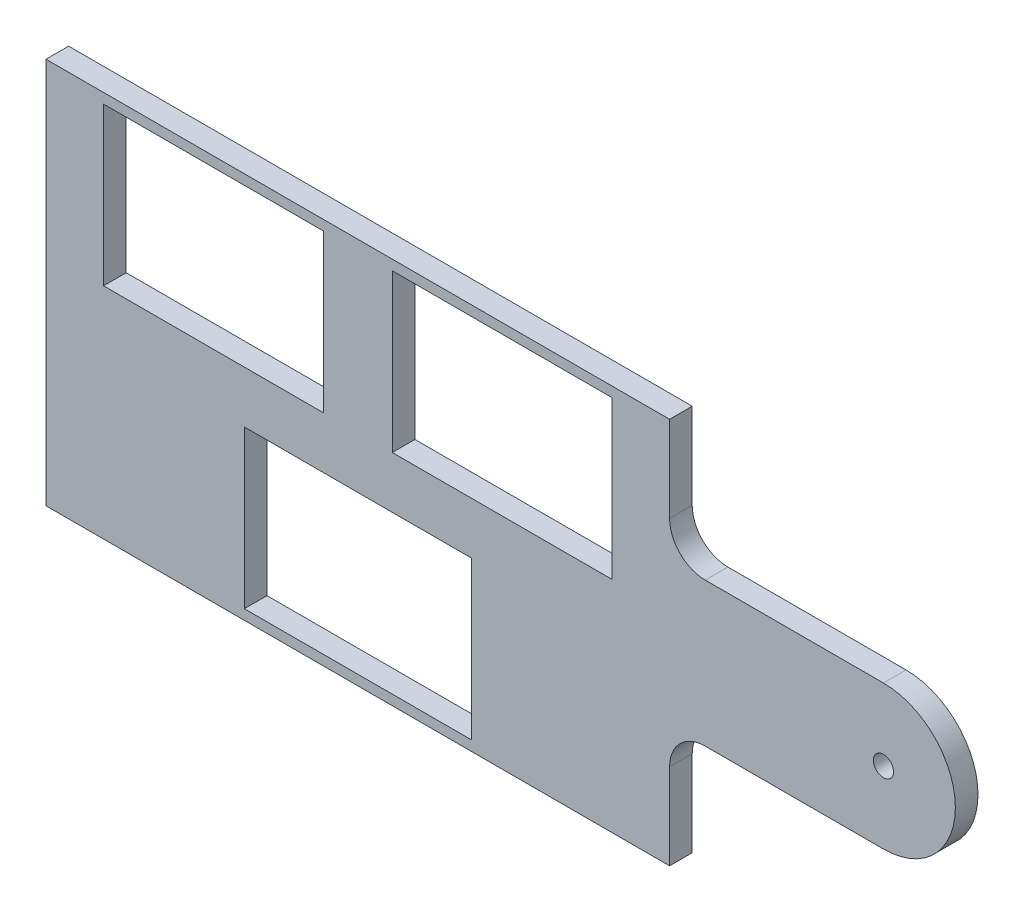
ISO-10303-21;
HEADER;
FILE_DESCRIPTION(('STEP AP214'),'2;1');
FILE_NAME('part.step','',(''),(''),'','','');
FILE_SCHEMA(('AUTOMOTIVE_DESIGN { 1 0 10303 214 1 1 1 1 }'));
ENDSEC;
DATA;
#1=APPLICATION_CONTEXT('core data for automotive mechanical design processes');
#2=APPLICATION_PROTOCOL_DEFINITION('international standard','automotive_design',2000,#1);
#3=PRODUCT_CONTEXT('',#1,'mechanical');
#4=PRODUCT('Part','Part','',(#3));
#5=PRODUCT_RELATED_PRODUCT_CATEGORY('part','',(#4));
#6=PRODUCT_DEFINITION_FORMATION('','',#4);
#7=PRODUCT_DEFINITION_CONTEXT('part definition',#1,'design');
#8=PRODUCT_DEFINITION('design','',#6,#7);
#9=PRODUCT_DEFINITION_SHAPE('','',#8);
#10=(LENGTH_UNIT() NAMED_UNIT(*) SI_UNIT(.MILLI.,.METRE.));
#11=(NAMED_UNIT(*) PLANE_ANGLE_UNIT() SI_UNIT($,.RADIAN.));
#12=(NAMED_UNIT(*) SI_UNIT($,.STERADIAN.) SOLID_ANGLE_UNIT());
#13=UNCERTAINTY_MEASURE_WITH_UNIT(LENGTH_MEASURE(1.E-05),#10,'distance_accuracy_value','');
#14=(GEOMETRIC_REPRESENTATION_CONTEXT(3) GLOBAL_UNCERTAINTY_ASSIGNED_CONTEXT((#13)) GLOBAL_UNIT_ASSIGNED_CONTEXT((#10,
#11,#12)) REPRESENTATION_CONTEXT('',''));
#15=CARTESIAN_POINT('',(0.,0.,0.));
#16=DIRECTION('',(0.,0.,1.));
#17=DIRECTION('',(1.,0.,0.));
#18=AXIS2_PLACEMENT_3D('',#15,#16,#17);
#19=CARTESIAN_POINT('',(0.,0.,3.175));
#20=DIRECTION('',(0.,0.,1.));
#21=DIRECTION('',(1.,0.,0.));
#22=AXIS2_PLACEMENT_3D('',#19,#20,#21);
#23=PLANE('',#22);
#24=DIRECTION('',(0.,-1.,0.));
#25=VECTOR('',#24,1.);
#26=CARTESIAN_POINT('',(-15.915,-3.63500000000001,3.175));
#27=LINE('',#26,#25);
#28=CARTESIAN_POINT('',(-15.915,-3.63500000000001,3.175));
#29=VERTEX_POINT('',#28);
#30=CARTESIAN_POINT('',(-15.915,-25.715,3.175));
#31=VERTEX_POINT('',#30);
#32=EDGE_CURVE('E51',#29,#31,#27,.T.);
#33=ORIENTED_EDGE('',*,*,#32,.F.);
#34=DIRECTION('',(-1.,0.,0.));
#35=VECTOR('',#34,1.);
#36=CARTESIAN_POINT('',(15.915,-3.63500000000001,3.175));
#37=LINE('',#36,#35);
#38=CARTESIAN_POINT('',(15.915,-3.63500000000001,3.175));
#39=VERTEX_POINT('',#38);
#40=EDGE_CURVE('E249',#39,#29,#37,.T.);
#41=ORIENTED_EDGE('',*,*,#40,.F.);
#42=DIRECTION('',(0.,-1.,0.));
#43=VECTOR('',#42,1.);
#44=CARTESIAN_POINT('',(15.915,-3.63500000000001,3.175));
#45=LINE('',#44,#43);
#46=CARTESIAN_POINT('',(15.915,-25.715,3.175));
#47=VERTEX_POINT('',#46);
#48=EDGE_CURVE('E257',#39,#47,#45,.T.);
#49=ORIENTED_EDGE('',*,*,#48,.T.);
#50=DIRECTION('',(1.,0.,0.));
#51=VECTOR('',#50,1.);
#52=CARTESIAN_POINT('',(-15.915,-25.715,3.175));
#53=LINE('',#52,#51);
#54=EDGE_CURVE('E260',#31,#47,#53,.T.);
#55=ORIENTED_EDGE('',*,*,#54,.F.);
#56=EDGE_LOOP('',(#33,#41,#49,#55));
#57=FACE_BOUND('',#56,.T.);
#58=DIRECTION('',(0.,1.,0.));
#59=VECTOR('',#58,1.);
#60=CARTESIAN_POINT('',(43.735,30.3,3.175));
#61=LINE('',#60,#59);
#62=CARTESIAN_POINT('',(43.735,15.085,3.175));
#63=VERTEX_POINT('',#62);
#64=CARTESIAN_POINT('',(43.735,27.125,3.175));
#65=VERTEX_POINT('',#64);
#66=EDGE_CURVE('E198',#63,#65,#61,.T.);
#67=ORIENTED_EDGE('',*,*,#66,.T.);
#68=DIRECTION('',(-1.,0.,0.));
#69=VECTOR('',#68,1.);
#70=CARTESIAN_POINT('',(-43.735,27.125,3.175));
#71=LINE('',#70,#69);
#72=CARTESIAN_POINT('',(-43.735,27.125,3.175));
#73=VERTEX_POINT('',#72);
#74=EDGE_CURVE('E217',#65,#73,#71,.T.);
#75=ORIENTED_EDGE('',*,*,#74,.T.);
#76=DIRECTION('',(0.,-1.,0.));
#77=VECTOR('',#76,1.);
#78=CARTESIAN_POINT('',(-43.735,30.3,3.175));
#79=LINE('',#78,#77);
#80=CARTESIAN_POINT('',(-43.735,-27.125,3.175));
#81=VERTEX_POINT('',#80);
#82=EDGE_CURVE('E312',#73,#81,#79,.T.);
#83=ORIENTED_EDGE('',*,*,#82,.T.);
#84=DIRECTION('',(1.,0.,0.));
#85=VECTOR('',#84,1.);
#86=CARTESIAN_POINT('',(43.735,-27.125,3.175));
#87=LINE('',#86,#85);
#88=CARTESIAN_POINT('',(43.735,-27.125,3.175));
#89=VERTEX_POINT('',#88);
#90=EDGE_CURVE('E207',#81,#89,#87,.T.);
#91=ORIENTED_EDGE('',*,*,#90,.T.);
#92=CARTESIAN_POINT('',(43.735,-15.085,3.175));
#93=VERTEX_POINT('',#92);
#94=EDGE_CURVE('E310',#89,#93,#61,.T.);
#95=ORIENTED_EDGE('',*,*,#94,.T.);
#96=CARTESIAN_POINT('',(48.735,-15.085,3.175));
#97=DIRECTION('',(0.,0.,1.));
#98=DIRECTION('',(1.,0.,0.));
#99=AXIS2_PLACEMENT_3D('',#96,#97,#98);
#100=CIRCLE('',#99,5.);
#101=CARTESIAN_POINT('',(48.735,-10.085,3.175));
#102=VERTEX_POINT('',#101);
#103=EDGE_CURVE('E325',#93,#102,#100,.F.);
#104=ORIENTED_EDGE('',*,*,#103,.T.);
#105=DIRECTION('',(1.,0.,0.));
#106=VECTOR('',#105,1.);
#107=CARTESIAN_POINT('',(43.735,-10.085,3.175));
#108=LINE('',#107,#106);
#109=CARTESIAN_POINT('',(73.735,-10.085,3.175));
#110=VERTEX_POINT('',#109);
#111=EDGE_CURVE('E292',#102,#110,#108,.T.);
#112=ORIENTED_EDGE('',*,*,#111,.T.);
#113=CARTESIAN_POINT('',(73.735,0.,3.175));
#114=DIRECTION('',(0.,0.,1.));
#115=DIRECTION('',(-1.,0.,0.));
#116=AXIS2_PLACEMENT_3D('',#113,#114,#115);
#117=CIRCLE('',#116,10.085);
#118=CARTESIAN_POINT('',(73.735,10.085,3.175));
#119=VERTEX_POINT('',#118);
#120=EDGE_CURVE('E298',#110,#119,#117,.T.);
#121=ORIENTED_EDGE('',*,*,#120,.T.);
#122=DIRECTION('',(-1.,0.,0.));
#123=VECTOR('',#122,1.);
#124=CARTESIAN_POINT('',(43.735,10.085,3.175));
#125=LINE('',#124,#123);
#126=CARTESIAN_POINT('',(48.735,10.085,3.175));
#127=VERTEX_POINT('',#126);
#128=EDGE_CURVE('E301',#119,#127,#125,.T.);
#129=ORIENTED_EDGE('',*,*,#128,.T.);
#130=CARTESIAN_POINT('',(48.735,15.085,3.175));
#131=DIRECTION('',(0.,0.,1.));
#132=DIRECTION('',(1.,0.,0.));
#133=AXIS2_PLACEMENT_3D('',#130,#131,#132);
#134=CIRCLE('',#133,5.);
#135=EDGE_CURVE('E329',#127,#63,#134,.F.);
#136=ORIENTED_EDGE('',*,*,#135,.T.);
#137=EDGE_LOOP('',(#67,#75,#83,#91,#95,#104,#112,#121,#129,#136));
#138=FACE_BOUND('',#137,.T.);
#139=CARTESIAN_POINT('',(73.735,0.,3.175));
#140=DIRECTION('',(0.,0.,1.));
#141=DIRECTION('',(1.,0.,0.));
#142=AXIS2_PLACEMENT_3D('',#139,#140,#141);
#143=CIRCLE('',#142,1.415);
#144=CARTESIAN_POINT('',(75.15,0.,3.175));
#145=VERTEX_POINT('',#144);
#146=EDGE_CURVE('E284',#145,#145,#143,.T.);
#147=ORIENTED_EDGE('',*,*,#146,.F.);
#148=EDGE_LOOP('',(#147));
#149=FACE_BOUND('',#148,.T.);
#150=DIRECTION('',(0.,-1.,0.));
#151=VECTOR('',#150,1.);
#152=CARTESIAN_POINT('',(-35.665,25.715,3.175));
#153=LINE('',#152,#151);
#154=CARTESIAN_POINT('',(-35.665,25.715,3.175));
#155=VERTEX_POINT('',#154);
#156=CARTESIAN_POINT('',(-35.665,3.635,3.175));
#157=VERTEX_POINT('',#156);
#158=EDGE_CURVE('E272',#155,#157,#153,.T.);
#159=ORIENTED_EDGE('',*,*,#158,.F.);
#160=DIRECTION('',(1.,0.,0.));
#161=VECTOR('',#160,1.);
#162=CARTESIAN_POINT('',(-35.665,25.715,3.175));
#163=LINE('',#162,#161);
#164=CARTESIAN_POINT('',(-4.835,25.715,3.175));
#165=VERTEX_POINT('',#164);
#166=EDGE_CURVE('E246',#155,#165,#163,.T.);
#167=ORIENTED_EDGE('',*,*,#166,.T.);
#168=DIRECTION('',(0.,-1.,0.));
#169=VECTOR('',#168,1.);
#170=CARTESIAN_POINT('',(-4.835,25.715,3.175));
#171=LINE('',#170,#169);
#172=CARTESIAN_POINT('',(-4.835,3.635,3.175));
#173=VERTEX_POINT('',#172);
#174=EDGE_CURVE('E266',#165,#173,#171,.T.);
#175=ORIENTED_EDGE('',*,*,#174,.T.);
#176=DIRECTION('',(1.,0.,0.));
#177=VECTOR('',#176,1.);
#178=CARTESIAN_POINT('',(-35.665,3.635,3.175));
#179=LINE('',#178,#177);
#180=EDGE_CURVE('E269',#157,#173,#179,.T.);
#181=ORIENTED_EDGE('',*,*,#180,.F.);
#182=EDGE_LOOP('',(#159,#167,#175,#181));
#183=FACE_BOUND('',#182,.T.);
#184=DIRECTION('',(-1.,0.,0.));
#185=VECTOR('',#184,1.);
#186=CARTESIAN_POINT('',(35.665,25.715,3.175));
#187=LINE('',#186,#185);
#188=CARTESIAN_POINT('',(35.665,25.715,3.175));
#189=VERTEX_POINT('',#188);
#190=CARTESIAN_POINT('',(4.835,25.715,3.175));
#191=VERTEX_POINT('',#190);
#192=EDGE_CURVE('E236',#189,#191,#187,.T.);
#193=ORIENTED_EDGE('',*,*,#192,.F.);
#194=DIRECTION('',(0.,-1.,0.));
#195=VECTOR('',#194,1.);
#196=CARTESIAN_POINT('',(35.665,25.715,3.175));
#197=LINE('',#196,#195);
#198=CARTESIAN_POINT('',(35.665,3.635,3.175));
#199=VERTEX_POINT('',#198);
#200=EDGE_CURVE('E59',#189,#199,#197,.T.);
#201=ORIENTED_EDGE('',*,*,#200,.T.);
#202=DIRECTION('',(-1.,0.,0.));
#203=VECTOR('',#202,1.);
#204=CARTESIAN_POINT('',(35.665,3.635,3.175));
#205=LINE('',#204,#203);
#206=CARTESIAN_POINT('',(4.835,3.635,3.175));
#207=VERTEX_POINT('',#206);
#208=EDGE_CURVE('E242',#199,#207,#205,.T.);
#209=ORIENTED_EDGE('',*,*,#208,.T.);
#210=DIRECTION('',(0.,-1.,0.));
#211=VECTOR('',#210,1.);
#212=CARTESIAN_POINT('',(4.835,25.715,3.175));
#213=LINE('',#212,#211);
#214=EDGE_CURVE('E239',#191,#207,#213,.T.);
#215=ORIENTED_EDGE('',*,*,#214,.F.);
#216=EDGE_LOOP('',(#193,#201,#209,#215));
#217=FACE_BOUND('',#216,.T.);
#218=ADVANCED_FACE('F36',(#57,#138,#149,#183,#217),#23,.T.);
#219=CARTESIAN_POINT('',(0.,0.,0.));
#220=DIRECTION('',(0.,0.,1.));
#221=DIRECTION('',(1.,0.,0.));
#222=AXIS2_PLACEMENT_3D('',#219,#220,#221);
#223=PLANE('',#222);
#224=DIRECTION('',(-1.,0.,0.));
#225=VECTOR('',#224,1.);
#226=CARTESIAN_POINT('',(0.,-3.63500000000001,0.));
#227=LINE('',#226,#225);
#228=CARTESIAN_POINT('',(15.915,-3.63500000000001,0.));
#229=VERTEX_POINT('',#228);
#230=CARTESIAN_POINT('',(-15.915,-3.63500000000001,0.));
#231=VERTEX_POINT('',#230);
#232=EDGE_CURVE('E44',#229,#231,#227,.T.);
#233=ORIENTED_EDGE('',*,*,#232,.T.);
#234=DIRECTION('',(0.,-1.,0.));
#235=VECTOR('',#234,1.);
#236=CARTESIAN_POINT('',(-15.915,0.,0.));
#237=LINE('',#236,#235);
#238=CARTESIAN_POINT('',(-15.915,-25.715,0.));
#239=VERTEX_POINT('',#238);
#240=EDGE_CURVE('E11',#231,#239,#237,.T.);
#241=ORIENTED_EDGE('',*,*,#240,.T.);
#242=DIRECTION('',(1.,0.,0.));
#243=VECTOR('',#242,1.);
#244=CARTESIAN_POINT('',(0.,-25.715,0.));
#245=LINE('',#244,#243);
#246=CARTESIAN_POINT('',(15.915,-25.715,0.));
#247=VERTEX_POINT('',#246);
#248=EDGE_CURVE('E355',#239,#247,#245,.T.);
#249=ORIENTED_EDGE('',*,*,#248,.T.);
#250=DIRECTION('',(0.,-1.,0.));
#251=VECTOR('',#250,1.);
#252=CARTESIAN_POINT('',(15.915,0.,0.));
#253=LINE('',#252,#251);
#254=EDGE_CURVE('E358',#229,#247,#253,.T.);
#255=ORIENTED_EDGE('',*,*,#254,.F.);
#256=EDGE_LOOP('',(#233,#241,#249,#255));
#257=FACE_BOUND('',#256,.T.);
#258=DIRECTION('',(1.,0.,0.));
#259=VECTOR('',#258,1.);
#260=CARTESIAN_POINT('',(0.,25.715,0.));
#261=LINE('',#260,#259);
#262=CARTESIAN_POINT('',(-35.665,25.715,0.));
#263=VERTEX_POINT('',#262);
#264=CARTESIAN_POINT('',(-4.835,25.715,0.));
#265=VERTEX_POINT('',#264);
#266=EDGE_CURVE('E343',#263,#265,#261,.T.);
#267=ORIENTED_EDGE('',*,*,#266,.F.);
#268=DIRECTION('',(0.,-1.,0.));
#269=VECTOR('',#268,1.);
#270=CARTESIAN_POINT('',(-35.665,0.,0.));
#271=LINE('',#270,#269);
#272=CARTESIAN_POINT('',(-35.665,3.635,0.));
#273=VERTEX_POINT('',#272);
#274=EDGE_CURVE('E333',#263,#273,#271,.T.);
#275=ORIENTED_EDGE('',*,*,#274,.T.);
#276=DIRECTION('',(1.,0.,0.));
#277=VECTOR('',#276,1.);
#278=CARTESIAN_POINT('',(0.,3.635,0.));
#279=LINE('',#278,#277);
#280=CARTESIAN_POINT('',(-4.835,3.635,0.));
#281=VERTEX_POINT('',#280);
#282=EDGE_CURVE('E338',#273,#281,#279,.T.);
#283=ORIENTED_EDGE('',*,*,#282,.T.);
#284=DIRECTION('',(0.,-1.,0.));
#285=VECTOR('',#284,1.);
#286=CARTESIAN_POINT('',(-4.835,0.,0.));
#287=LINE('',#286,#285);
#288=EDGE_CURVE('E341',#265,#281,#287,.T.);
#289=ORIENTED_EDGE('',*,*,#288,.F.);
#290=EDGE_LOOP('',(#267,#275,#283,#289));
#291=FACE_BOUND('',#290,.T.);
#292=CARTESIAN_POINT('',(73.735,0.,0.));
#293=DIRECTION('',(0.,0.,1.));
#294=DIRECTION('',(1.,0.,0.));
#295=AXIS2_PLACEMENT_3D('',#292,#293,#294);
#296=CIRCLE('',#295,1.415);
#297=CARTESIAN_POINT('',(75.15,0.,0.));
#298=VERTEX_POINT('',#297);
#299=EDGE_CURVE('E287',#298,#298,#296,.T.);
#300=ORIENTED_EDGE('',*,*,#299,.T.);
#301=EDGE_LOOP('',(#300));
#302=FACE_BOUND('',#301,.T.);
#303=DIRECTION('',(0.,-1.,0.));
#304=VECTOR('',#303,1.);
#305=CARTESIAN_POINT('',(-43.735,30.3,0.));
#306=LINE('',#305,#304);
#307=CARTESIAN_POINT('',(-43.735,27.125,0.));
#308=VERTEX_POINT('',#307);
#309=CARTESIAN_POINT('',(-43.735,-27.125,0.));
#310=VERTEX_POINT('',#309);
#311=EDGE_CURVE('E187',#308,#310,#306,.T.);
#312=ORIENTED_EDGE('',*,*,#311,.F.);
#313=DIRECTION('',(-1.,0.,0.));
#314=VECTOR('',#313,1.);
#315=CARTESIAN_POINT('',(-43.735,27.125,0.));
#316=LINE('',#315,#314);
#317=CARTESIAN_POINT('',(43.735,27.125,0.));
#318=VERTEX_POINT('',#317);
#319=EDGE_CURVE('E219',#318,#308,#316,.T.);
#320=ORIENTED_EDGE('',*,*,#319,.F.);
#321=DIRECTION('',(0.,1.,0.));
#322=VECTOR('',#321,1.);
#323=CARTESIAN_POINT('',(43.735,30.3,0.));
#324=LINE('',#323,#322);
#325=CARTESIAN_POINT('',(43.735,15.085,0.));
#326=VERTEX_POINT('',#325);
#327=EDGE_CURVE('E308',#326,#318,#324,.T.);
#328=ORIENTED_EDGE('',*,*,#327,.F.);
#329=CARTESIAN_POINT('',(48.735,15.085,0.));
#330=DIRECTION('',(0.,0.,1.));
#331=DIRECTION('',(1.,0.,0.));
#332=AXIS2_PLACEMENT_3D('',#329,#330,#331);
#333=CIRCLE('',#332,5.);
#334=CARTESIAN_POINT('',(48.735,10.085,0.));
#335=VERTEX_POINT('',#334);
#336=EDGE_CURVE('E331',#326,#335,#333,.T.);
#337=ORIENTED_EDGE('',*,*,#336,.T.);
#338=DIRECTION('',(-1.,0.,0.));
#339=VECTOR('',#338,1.);
#340=CARTESIAN_POINT('',(43.735,10.085,0.));
#341=LINE('',#340,#339);
#342=CARTESIAN_POINT('',(73.735,10.085,0.));
#343=VERTEX_POINT('',#342);
#344=EDGE_CURVE('E291',#343,#335,#341,.T.);
#345=ORIENTED_EDGE('',*,*,#344,.F.);
#346=CARTESIAN_POINT('',(73.735,0.,0.));
#347=DIRECTION('',(0.,0.,1.));
#348=DIRECTION('',(-1.,0.,0.));
#349=AXIS2_PLACEMENT_3D('',#346,#347,#348);
#350=CIRCLE('',#349,10.085);
#351=CARTESIAN_POINT('',(73.735,-10.085,0.));
#352=VERTEX_POINT('',#351);
#353=EDGE_CURVE('E288',#352,#343,#350,.T.);
#354=ORIENTED_EDGE('',*,*,#353,.F.);
#355=DIRECTION('',(1.,0.,0.));
#356=VECTOR('',#355,1.);
#357=CARTESIAN_POINT('',(43.735,-10.085,0.));
#358=LINE('',#357,#356);
#359=CARTESIAN_POINT('',(48.735,-10.085,0.));
#360=VERTEX_POINT('',#359);
#361=EDGE_CURVE('E295',#360,#352,#358,.T.);
#362=ORIENTED_EDGE('',*,*,#361,.F.);
#363=CARTESIAN_POINT('',(48.735,-15.085,0.));
#364=DIRECTION('',(0.,0.,1.));
#365=DIRECTION('',(1.,0.,0.));
#366=AXIS2_PLACEMENT_3D('',#363,#364,#365);
#367=CIRCLE('',#366,5.);
#368=CARTESIAN_POINT('',(43.735,-15.085,0.));
#369=VERTEX_POINT('',#368);
#370=EDGE_CURVE('E327',#360,#369,#367,.T.);
#371=ORIENTED_EDGE('',*,*,#370,.T.);
#372=CARTESIAN_POINT('',(43.735,-27.125,0.));
#373=VERTEX_POINT('',#372);
#374=EDGE_CURVE('E199',#373,#369,#324,.T.);
#375=ORIENTED_EDGE('',*,*,#374,.F.);
#376=DIRECTION('',(1.,0.,0.));
#377=VECTOR('',#376,1.);
#378=CARTESIAN_POINT('',(43.735,-27.125,0.));
#379=LINE('',#378,#377);
#380=EDGE_CURVE('E205',#310,#373,#379,.T.);
#381=ORIENTED_EDGE('',*,*,#380,.F.);
#382=EDGE_LOOP('',(#312,#320,#328,#337,#345,#354,#362,#371,#375,#381));
#383=FACE_BOUND('',#382,.T.);
#384=DIRECTION('',(0.,-1.,0.));
#385=VECTOR('',#384,1.);
#386=CARTESIAN_POINT('',(35.665,0.,0.));
#387=LINE('',#386,#385);
#388=CARTESIAN_POINT('',(35.665,25.715,0.));
#389=VERTEX_POINT('',#388);
#390=CARTESIAN_POINT('',(35.665,3.635,0.));
#391=VERTEX_POINT('',#390);
#392=EDGE_CURVE('E353',#389,#391,#387,.T.);
#393=ORIENTED_EDGE('',*,*,#392,.F.);
#394=DIRECTION('',(-1.,0.,0.));
#395=VECTOR('',#394,1.);
#396=CARTESIAN_POINT('',(0.,25.715,0.));
#397=LINE('',#396,#395);
#398=CARTESIAN_POINT('',(4.835,25.715,0.));
#399=VERTEX_POINT('',#398);
#400=EDGE_CURVE('E345',#389,#399,#397,.T.);
#401=ORIENTED_EDGE('',*,*,#400,.T.);
#402=DIRECTION('',(0.,-1.,0.));
#403=VECTOR('',#402,1.);
#404=CARTESIAN_POINT('',(4.835,0.,0.));
#405=LINE('',#404,#403);
#406=CARTESIAN_POINT('',(4.835,3.635,0.));
#407=VERTEX_POINT('',#406);
#408=EDGE_CURVE('E348',#399,#407,#405,.T.);
#409=ORIENTED_EDGE('',*,*,#408,.T.);
#410=DIRECTION('',(-1.,0.,0.));
#411=VECTOR('',#410,1.);
#412=CARTESIAN_POINT('',(0.,3.635,0.));
#413=LINE('',#412,#411);
#414=EDGE_CURVE('E351',#391,#407,#413,.T.);
#415=ORIENTED_EDGE('',*,*,#414,.F.);
#416=EDGE_LOOP('',(#393,#401,#409,#415));
#417=FACE_BOUND('',#416,.T.);
#418=ADVANCED_FACE('F210',(#257,#291,#302,#383,#417),#223,.F.);
#419=CARTESIAN_POINT('',(43.735,30.3,3.175));
#420=DIRECTION('',(-1.,0.,0.));
#421=DIRECTION('',(0.,-1.,0.));
#422=AXIS2_PLACEMENT_3D('',#419,#420,#421);
#423=PLANE('',#422);
#424=ORIENTED_EDGE('',*,*,#327,.T.);
#425=DIRECTION('',(0.,0.,1.));
#426=VECTOR('',#425,1.);
#427=CARTESIAN_POINT('',(43.735,27.125,0.));
#428=LINE('',#427,#426);
#429=EDGE_CURVE('E221',#318,#65,#428,.T.);
#430=ORIENTED_EDGE('',*,*,#429,.T.);
#431=ORIENTED_EDGE('',*,*,#66,.F.);
#432=DIRECTION('',(0.,0.,1.));
#433=VECTOR('',#432,1.);
#434=CARTESIAN_POINT('',(43.735,15.085,3.175));
#435=LINE('',#434,#433);
#436=EDGE_CURVE('E323',#63,#326,#435,.F.);
#437=ORIENTED_EDGE('',*,*,#436,.T.);
#438=EDGE_LOOP('',(#424,#430,#431,#437));
#439=FACE_BOUND('',#438,.T.);
#440=ADVANCED_FACE('F396',(#439),#423,.F.);
#441=ORIENTED_EDGE('',*,*,#94,.F.);
#442=DIRECTION('',(0.,0.,1.));
#443=VECTOR('',#442,1.);
#444=CARTESIAN_POINT('',(43.735,-27.125,0.));
#445=LINE('',#444,#443);
#446=EDGE_CURVE('E208',#373,#89,#445,.T.);
#447=ORIENTED_EDGE('',*,*,#446,.F.);
#448=ORIENTED_EDGE('',*,*,#374,.T.);
#449=DIRECTION('',(0.,0.,1.));
#450=VECTOR('',#449,1.);
#451=CARTESIAN_POINT('',(43.735,-15.085,3.175));
#452=LINE('',#451,#450);
#453=EDGE_CURVE('E314',#369,#93,#452,.T.);
#454=ORIENTED_EDGE('',*,*,#453,.T.);
#455=EDGE_LOOP('',(#441,#447,#448,#454));
#456=FACE_BOUND('',#455,.T.);
#457=ADVANCED_FACE('F404',(#456),#423,.F.);
#458=CARTESIAN_POINT('',(-43.735,30.3,3.175));
#459=DIRECTION('',(1.,0.,0.));
#460=DIRECTION('',(0.,1.,0.));
#461=AXIS2_PLACEMENT_3D('',#458,#459,#460);
#462=PLANE('',#461);
#463=ORIENTED_EDGE('',*,*,#82,.F.);
#464=DIRECTION('',(0.,0.,1.));
#465=VECTOR('',#464,1.);
#466=CARTESIAN_POINT('',(-43.735,27.125,0.));
#467=LINE('',#466,#465);
#468=EDGE_CURVE('E193',#308,#73,#467,.T.);
#469=ORIENTED_EDGE('',*,*,#468,.F.);
#470=ORIENTED_EDGE('',*,*,#311,.T.);
#471=DIRECTION('',(0.,0.,1.));
#472=VECTOR('',#471,1.);
#473=CARTESIAN_POINT('',(-43.735,-27.125,0.));
#474=LINE('',#473,#472);
#475=EDGE_CURVE('E190',#310,#81,#474,.T.);
#476=ORIENTED_EDGE('',*,*,#475,.T.);
#477=EDGE_LOOP('',(#463,#469,#470,#476));
#478=FACE_BOUND('',#477,.T.);
#479=ADVANCED_FACE('F189',(#478),#462,.F.);
#480=CARTESIAN_POINT('',(73.735,0.,0.));
#481=DIRECTION('',(0.,0.,1.));
#482=DIRECTION('',(1.,0.,0.));
#483=AXIS2_PLACEMENT_3D('',#480,#481,#482);
#484=CYLINDRICAL_SURFACE('',#483,10.085);
#485=ORIENTED_EDGE('',*,*,#120,.F.);
#486=DIRECTION('',(0.,0.,1.));
#487=VECTOR('',#486,1.);
#488=CARTESIAN_POINT('',(73.735,-10.085,0.));
#489=LINE('',#488,#487);
#490=EDGE_CURVE('E305',#352,#110,#489,.T.);
#491=ORIENTED_EDGE('',*,*,#490,.F.);
#492=ORIENTED_EDGE('',*,*,#353,.T.);
#493=DIRECTION('',(0.,0.,1.));
#494=VECTOR('',#493,1.);
#495=CARTESIAN_POINT('',(73.735,10.085,0.));
#496=LINE('',#495,#494);
#497=EDGE_CURVE('E297',#343,#119,#496,.T.);
#498=ORIENTED_EDGE('',*,*,#497,.T.);
#499=EDGE_LOOP('',(#485,#491,#492,#498));
#500=FACE_BOUND('',#499,.T.);
#501=ADVANCED_FACE('F399',(#500),#484,.T.);
#502=CARTESIAN_POINT('',(43.735,-10.085,0.));
#503=DIRECTION('',(0.,-1.,0.));
#504=DIRECTION('',(1.,0.,0.));
#505=AXIS2_PLACEMENT_3D('',#502,#503,#504);
#506=PLANE('',#505);
#507=ORIENTED_EDGE('',*,*,#111,.F.);
#508=DIRECTION('',(0.,0.,1.));
#509=VECTOR('',#508,1.);
#510=CARTESIAN_POINT('',(48.735,-10.085,0.));
#511=LINE('',#510,#509);
#512=EDGE_CURVE('E318',#102,#360,#511,.F.);
#513=ORIENTED_EDGE('',*,*,#512,.T.);
#514=ORIENTED_EDGE('',*,*,#361,.T.);
#515=ORIENTED_EDGE('',*,*,#490,.T.);
#516=EDGE_LOOP('',(#507,#513,#514,#515));
#517=FACE_BOUND('',#516,.T.);
#518=ADVANCED_FACE('F417',(#517),#506,.T.);
#519=CARTESIAN_POINT('',(43.735,10.085,0.));
#520=DIRECTION('',(0.,1.,0.));
#521=DIRECTION('',(0.,0.,1.));
#522=AXIS2_PLACEMENT_3D('',#519,#520,#521);
#523=PLANE('',#522);
#524=ORIENTED_EDGE('',*,*,#344,.T.);
#525=DIRECTION('',(0.,0.,1.));
#526=VECTOR('',#525,1.);
#527=CARTESIAN_POINT('',(48.735,10.085,0.));
#528=LINE('',#527,#526);
#529=EDGE_CURVE('E320',#335,#127,#528,.T.);
#530=ORIENTED_EDGE('',*,*,#529,.T.);
#531=ORIENTED_EDGE('',*,*,#128,.F.);
#532=ORIENTED_EDGE('',*,*,#497,.F.);
#533=EDGE_LOOP('',(#524,#530,#531,#532));
#534=FACE_BOUND('',#533,.T.);
#535=ADVANCED_FACE('F409',(#534),#523,.T.);
#536=CARTESIAN_POINT('',(48.735,-15.085,3.175));
#537=DIRECTION('',(0.,0.,1.));
#538=DIRECTION('',(1.,0.,0.));
#539=AXIS2_PLACEMENT_3D('',#536,#537,#538);
#540=CYLINDRICAL_SURFACE('',#539,5.);
#541=ORIENTED_EDGE('',*,*,#370,.F.);
#542=ORIENTED_EDGE('',*,*,#512,.F.);
#543=ORIENTED_EDGE('',*,*,#103,.F.);
#544=ORIENTED_EDGE('',*,*,#453,.F.);
#545=EDGE_LOOP('',(#541,#542,#543,#544));
#546=FACE_BOUND('',#545,.T.);
#547=ADVANCED_FACE('F407',(#546),#540,.F.);
#548=CARTESIAN_POINT('',(48.735,15.085,0.));
#549=DIRECTION('',(0.,0.,1.));
#550=DIRECTION('',(1.,0.,0.));
#551=AXIS2_PLACEMENT_3D('',#548,#549,#550);
#552=CYLINDRICAL_SURFACE('',#551,5.);
#553=ORIENTED_EDGE('',*,*,#336,.F.);
#554=ORIENTED_EDGE('',*,*,#436,.F.);
#555=ORIENTED_EDGE('',*,*,#135,.F.);
#556=ORIENTED_EDGE('',*,*,#529,.F.);
#557=EDGE_LOOP('',(#553,#554,#555,#556));
#558=FACE_BOUND('',#557,.T.);
#559=ADVANCED_FACE('F38',(#558),#552,.F.);
#560=CARTESIAN_POINT('',(73.735,0.,-6.825));
#561=DIRECTION('',(0.,0.,1.));
#562=DIRECTION('',(1.,0.,0.));
#563=AXIS2_PLACEMENT_3D('',#560,#561,#562);
#564=CYLINDRICAL_SURFACE('',#563,1.415);
#565=ORIENTED_EDGE('',*,*,#146,.T.);
#566=EDGE_LOOP('',(#565));
#567=FACE_BOUND('',#566,.T.);
#568=ORIENTED_EDGE('',*,*,#299,.F.);
#569=EDGE_LOOP('',(#568));
#570=FACE_BOUND('',#569,.T.);
#571=ADVANCED_FACE('F415',(#567,#570),#564,.F.);
#572=CARTESIAN_POINT('',(-35.665,25.715,-6.825));
#573=DIRECTION('',(0.,-1.,0.));
#574=DIRECTION('',(0.,0.,-1.));
#575=AXIS2_PLACEMENT_3D('',#572,#573,#574);
#576=PLANE('',#575);
#577=ORIENTED_EDGE('',*,*,#266,.T.);
#578=DIRECTION('',(0.,0.,1.));
#579=VECTOR('',#578,1.);
#580=CARTESIAN_POINT('',(-4.835,25.715,-6.825));
#581=LINE('',#580,#579);
#582=EDGE_CURVE('E282',#265,#165,#581,.T.);
#583=ORIENTED_EDGE('',*,*,#582,.T.);
#584=ORIENTED_EDGE('',*,*,#166,.F.);
#585=DIRECTION('',(0.,0.,1.));
#586=VECTOR('',#585,1.);
#587=CARTESIAN_POINT('',(-35.665,25.715,-6.825));
#588=LINE('',#587,#586);
#589=EDGE_CURVE('E275',#263,#155,#588,.T.);
#590=ORIENTED_EDGE('',*,*,#589,.F.);
#591=EDGE_LOOP('',(#577,#583,#584,#590));
#592=FACE_BOUND('',#591,.T.);
#593=ADVANCED_FACE('F590',(#592),#576,.T.);
#594=CARTESIAN_POINT('',(-4.835,25.715,-6.825));
#595=DIRECTION('',(-1.,0.,0.));
#596=DIRECTION('',(0.,-1.,0.));
#597=AXIS2_PLACEMENT_3D('',#594,#595,#596);
#598=PLANE('',#597);
#599=ORIENTED_EDGE('',*,*,#288,.T.);
#600=DIRECTION('',(0.,0.,1.));
#601=VECTOR('',#600,1.);
#602=CARTESIAN_POINT('',(-4.835,3.635,-6.825));
#603=LINE('',#602,#601);
#604=EDGE_CURVE('E280',#281,#173,#603,.T.);
#605=ORIENTED_EDGE('',*,*,#604,.T.);
#606=ORIENTED_EDGE('',*,*,#174,.F.);
#607=ORIENTED_EDGE('',*,*,#582,.F.);
#608=EDGE_LOOP('',(#599,#605,#606,#607));
#609=FACE_BOUND('',#608,.T.);
#610=ADVANCED_FACE('F580',(#609),#598,.T.);
#611=CARTESIAN_POINT('',(-35.665,3.635,-6.825));
#612=DIRECTION('',(0.,-1.,0.));
#613=DIRECTION('',(0.,0.,-1.));
#614=AXIS2_PLACEMENT_3D('',#611,#612,#613);
#615=PLANE('',#614);
#616=DIRECTION('',(0.,0.,1.));
#617=VECTOR('',#616,1.);
#618=CARTESIAN_POINT('',(-35.665,3.635,-6.825));
#619=LINE('',#618,#617);
#620=EDGE_CURVE('E278',#273,#157,#619,.T.);
#621=ORIENTED_EDGE('',*,*,#620,.T.);
#622=ORIENTED_EDGE('',*,*,#180,.T.);
#623=ORIENTED_EDGE('',*,*,#604,.F.);
#624=ORIENTED_EDGE('',*,*,#282,.F.);
#625=EDGE_LOOP('',(#621,#622,#623,#624));
#626=FACE_BOUND('',#625,.T.);
#627=ADVANCED_FACE('F570',(#626),#615,.F.);
#628=CARTESIAN_POINT('',(-35.665,25.715,-6.825));
#629=DIRECTION('',(-1.,0.,0.));
#630=DIRECTION('',(0.,0.,1.));
#631=AXIS2_PLACEMENT_3D('',#628,#629,#630);
#632=PLANE('',#631);
#633=ORIENTED_EDGE('',*,*,#589,.T.);
#634=ORIENTED_EDGE('',*,*,#158,.T.);
#635=ORIENTED_EDGE('',*,*,#620,.F.);
#636=ORIENTED_EDGE('',*,*,#274,.F.);
#637=EDGE_LOOP('',(#633,#634,#635,#636));
#638=FACE_BOUND('',#637,.T.);
#639=ADVANCED_FACE('F561',(#638),#632,.F.);
#640=CARTESIAN_POINT('',(35.665,25.715,-6.825));
#641=DIRECTION('',(-1.,0.,0.));
#642=DIRECTION('',(0.,0.,1.));
#643=AXIS2_PLACEMENT_3D('',#640,#641,#642);
#644=PLANE('',#643);
#645=ORIENTED_EDGE('',*,*,#392,.T.);
#646=DIRECTION('',(0.,0.,1.));
#647=VECTOR('',#646,1.);
#648=CARTESIAN_POINT('',(35.665,3.635,-6.825));
#649=LINE('',#648,#647);
#650=EDGE_CURVE('E228',#391,#199,#649,.T.);
#651=ORIENTED_EDGE('',*,*,#650,.T.);
#652=ORIENTED_EDGE('',*,*,#200,.F.);
#653=DIRECTION('',(0.,0.,1.));
#654=VECTOR('',#653,1.);
#655=CARTESIAN_POINT('',(35.665,25.715,-6.825));
#656=LINE('',#655,#654);
#657=EDGE_CURVE('E234',#389,#189,#656,.T.);
#658=ORIENTED_EDGE('',*,*,#657,.F.);
#659=EDGE_LOOP('',(#645,#651,#652,#658));
#660=FACE_BOUND('',#659,.T.);
#661=ADVANCED_FACE('F551',(#660),#644,.T.);
#662=CARTESIAN_POINT('',(35.665,3.635,-6.825));
#663=DIRECTION('',(0.,1.,0.));
#664=DIRECTION('',(0.,0.,1.));
#665=AXIS2_PLACEMENT_3D('',#662,#663,#664);
#666=PLANE('',#665);
#667=ORIENTED_EDGE('',*,*,#414,.T.);
#668=DIRECTION('',(0.,0.,1.));
#669=VECTOR('',#668,1.);
#670=CARTESIAN_POINT('',(4.835,3.635,-6.825));
#671=LINE('',#670,#669);
#672=EDGE_CURVE('E230',#407,#207,#671,.T.);
#673=ORIENTED_EDGE('',*,*,#672,.T.);
#674=ORIENTED_EDGE('',*,*,#208,.F.);
#675=ORIENTED_EDGE('',*,*,#650,.F.);
#676=EDGE_LOOP('',(#667,#673,#674,#675));
#677=FACE_BOUND('',#676,.T.);
#678=ADVANCED_FACE('F541',(#677),#666,.T.);
#679=CARTESIAN_POINT('',(4.835,25.715,-6.825));
#680=DIRECTION('',(-1.,0.,0.));
#681=DIRECTION('',(0.,-1.,0.));
#682=AXIS2_PLACEMENT_3D('',#679,#680,#681);
#683=PLANE('',#682);
#684=DIRECTION('',(0.,0.,1.));
#685=VECTOR('',#684,1.);
#686=CARTESIAN_POINT('',(4.835,25.715,-6.825));
#687=LINE('',#686,#685);
#688=EDGE_CURVE('E232',#399,#191,#687,.T.);
#689=ORIENTED_EDGE('',*,*,#688,.T.);
#690=ORIENTED_EDGE('',*,*,#214,.T.);
#691=ORIENTED_EDGE('',*,*,#672,.F.);
#692=ORIENTED_EDGE('',*,*,#408,.F.);
#693=EDGE_LOOP('',(#689,#690,#691,#692));
#694=FACE_BOUND('',#693,.T.);
#695=ADVANCED_FACE('F386',(#694),#683,.F.);
#696=CARTESIAN_POINT('',(35.665,25.715,-6.825));
#697=DIRECTION('',(0.,1.,0.));
#698=DIRECTION('',(0.,0.,1.));
#699=AXIS2_PLACEMENT_3D('',#696,#697,#698);
#700=PLANE('',#699);
#701=ORIENTED_EDGE('',*,*,#657,.T.);
#702=ORIENTED_EDGE('',*,*,#192,.T.);
#703=ORIENTED_EDGE('',*,*,#688,.F.);
#704=ORIENTED_EDGE('',*,*,#400,.F.);
#705=EDGE_LOOP('',(#701,#702,#703,#704));
#706=FACE_BOUND('',#705,.T.);
#707=ADVANCED_FACE('F379',(#706),#700,.F.);
#708=CARTESIAN_POINT('',(-15.915,-3.63500000000001,-6.825));
#709=DIRECTION('',(-1.,0.,0.));
#710=DIRECTION('',(0.,0.,1.));
#711=AXIS2_PLACEMENT_3D('',#708,#709,#710);
#712=PLANE('',#711);
#713=DIRECTION('',(0.,0.,1.));
#714=VECTOR('',#713,1.);
#715=CARTESIAN_POINT('',(-15.915,-3.63500000000001,-6.825));
#716=LINE('',#715,#714);
#717=EDGE_CURVE('E225',#231,#29,#716,.T.);
#718=ORIENTED_EDGE('',*,*,#717,.T.);
#719=ORIENTED_EDGE('',*,*,#32,.T.);
#720=DIRECTION('',(0.,0.,1.));
#721=VECTOR('',#720,1.);
#722=CARTESIAN_POINT('',(-15.915,-25.715,-6.825));
#723=LINE('',#722,#721);
#724=EDGE_CURVE('E247',#239,#31,#723,.T.);
#725=ORIENTED_EDGE('',*,*,#724,.F.);
#726=ORIENTED_EDGE('',*,*,#240,.F.);
#727=EDGE_LOOP('',(#718,#719,#725,#726));
#728=FACE_BOUND('',#727,.T.);
#729=ADVANCED_FACE('F377',(#728),#712,.F.);
#730=CARTESIAN_POINT('',(15.915,-3.63500000000001,-6.825));
#731=DIRECTION('',(0.,1.,0.));
#732=DIRECTION('',(0.,0.,1.));
#733=AXIS2_PLACEMENT_3D('',#730,#731,#732);
#734=PLANE('',#733);
#735=DIRECTION('',(0.,0.,1.));
#736=VECTOR('',#735,1.);
#737=CARTESIAN_POINT('',(15.915,-3.63500000000001,-6.825));
#738=LINE('',#737,#736);
#739=EDGE_CURVE('E252',#229,#39,#738,.T.);
#740=ORIENTED_EDGE('',*,*,#739,.T.);
#741=ORIENTED_EDGE('',*,*,#40,.T.);
#742=ORIENTED_EDGE('',*,*,#717,.F.);
#743=ORIENTED_EDGE('',*,*,#232,.F.);
#744=EDGE_LOOP('',(#740,#741,#742,#743));
#745=FACE_BOUND('',#744,.T.);
#746=ADVANCED_FACE('F367',(#745),#734,.F.);
#747=CARTESIAN_POINT('',(15.915,-3.63500000000001,-6.825));
#748=DIRECTION('',(-1.,0.,0.));
#749=DIRECTION('',(0.,0.,1.));
#750=AXIS2_PLACEMENT_3D('',#747,#748,#749);
#751=PLANE('',#750);
#752=ORIENTED_EDGE('',*,*,#254,.T.);
#753=DIRECTION('',(0.,0.,1.));
#754=VECTOR('',#753,1.);
#755=CARTESIAN_POINT('',(15.915,-25.715,-6.825));
#756=LINE('',#755,#754);
#757=EDGE_CURVE('E250',#247,#47,#756,.T.);
#758=ORIENTED_EDGE('',*,*,#757,.T.);
#759=ORIENTED_EDGE('',*,*,#48,.F.);
#760=ORIENTED_EDGE('',*,*,#739,.F.);
#761=EDGE_LOOP('',(#752,#758,#759,#760));
#762=FACE_BOUND('',#761,.T.);
#763=ADVANCED_FACE('F370',(#762),#751,.T.);
#764=CARTESIAN_POINT('',(-15.915,-25.715,-6.825));
#765=DIRECTION('',(0.,-1.,0.));
#766=DIRECTION('',(0.,0.,-1.));
#767=AXIS2_PLACEMENT_3D('',#764,#765,#766);
#768=PLANE('',#767);
#769=ORIENTED_EDGE('',*,*,#724,.T.);
#770=ORIENTED_EDGE('',*,*,#54,.T.);
#771=ORIENTED_EDGE('',*,*,#757,.F.);
#772=ORIENTED_EDGE('',*,*,#248,.F.);
#773=EDGE_LOOP('',(#769,#770,#771,#772));
#774=FACE_BOUND('',#773,.T.);
#775=ADVANCED_FACE('F376',(#774),#768,.F.);
#776=CARTESIAN_POINT('',(-43.735,27.125,0.));
#777=DIRECTION('',(0.,1.,0.));
#778=DIRECTION('',(0.,0.,1.));
#779=AXIS2_PLACEMENT_3D('',#776,#777,#778);
#780=PLANE('',#779);
#781=ORIENTED_EDGE('',*,*,#74,.F.);
#782=ORIENTED_EDGE('',*,*,#429,.F.);
#783=ORIENTED_EDGE('',*,*,#319,.T.);
#784=ORIENTED_EDGE('',*,*,#468,.T.);
#785=EDGE_LOOP('',(#781,#782,#783,#784));
#786=FACE_BOUND('',#785,.T.);
#787=ADVANCED_FACE('F435',(#786),#780,.T.);
#788=CARTESIAN_POINT('',(43.735,-27.125,0.));
#789=DIRECTION('',(0.,-1.,0.));
#790=DIRECTION('',(1.,0.,0.));
#791=AXIS2_PLACEMENT_3D('',#788,#789,#790);
#792=PLANE('',#791);
#793=ORIENTED_EDGE('',*,*,#90,.F.);
#794=ORIENTED_EDGE('',*,*,#475,.F.);
#795=ORIENTED_EDGE('',*,*,#380,.T.);
#796=ORIENTED_EDGE('',*,*,#446,.T.);
#797=EDGE_LOOP('',(#793,#794,#795,#796));
#798=FACE_BOUND('',#797,.T.);
#799=ADVANCED_FACE('F203',(#798),#792,.T.);
#800=CLOSED_SHELL('',(#218,#418,#440,#457,#479,#501,#518,#535,#547,#559,#571,#593,#610,#627,
#639,#661,#678,#695,#707,#729,#746,#763,#775,#787,#799));
#801=MANIFOLD_SOLID_BREP('B2',#800);
#802=ADVANCED_BREP_SHAPE_REPRESENTATION('',(#18,#801),#14);
#803=SHAPE_DEFINITION_REPRESENTATION(#9,#802);
ENDSEC;
END-ISO-10303-21;
